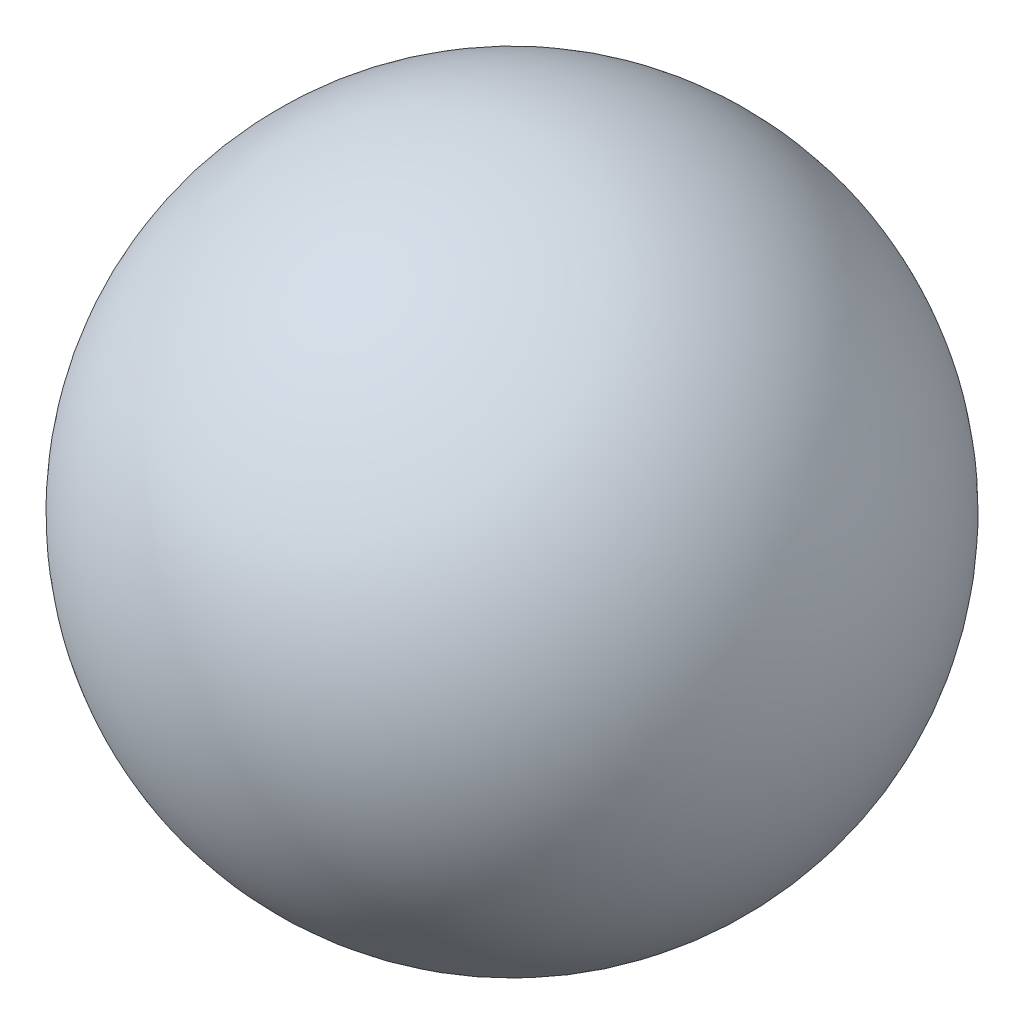
ISO-10303-21;
HEADER;
FILE_DESCRIPTION(('STEP AP214'),'2;1');
FILE_NAME('part.step','',(''),(''),'','','');
FILE_SCHEMA(('AUTOMOTIVE_DESIGN { 1 0 10303 214 1 1 1 1 }'));
ENDSEC;
DATA;
#1=APPLICATION_CONTEXT('core data for automotive mechanical design processes');
#2=APPLICATION_PROTOCOL_DEFINITION('international standard','automotive_design',2000,#1);
#3=PRODUCT_CONTEXT('',#1,'mechanical');
#4=PRODUCT('Part','Part','',(#3));
#5=PRODUCT_RELATED_PRODUCT_CATEGORY('part','',(#4));
#6=PRODUCT_DEFINITION_FORMATION('','',#4);
#7=PRODUCT_DEFINITION_CONTEXT('part definition',#1,'design');
#8=PRODUCT_DEFINITION('design','',#6,#7);
#9=PRODUCT_DEFINITION_SHAPE('','',#8);
#10=(LENGTH_UNIT() NAMED_UNIT(*) SI_UNIT(.MILLI.,.METRE.));
#11=(NAMED_UNIT(*) PLANE_ANGLE_UNIT() SI_UNIT($,.RADIAN.));
#12=(NAMED_UNIT(*) SI_UNIT($,.STERADIAN.) SOLID_ANGLE_UNIT());
#13=UNCERTAINTY_MEASURE_WITH_UNIT(LENGTH_MEASURE(1.E-05),#10,'distance_accuracy_value','');
#14=(GEOMETRIC_REPRESENTATION_CONTEXT(3) GLOBAL_UNCERTAINTY_ASSIGNED_CONTEXT((#13)) GLOBAL_UNIT_ASSIGNED_CONTEXT((#10,
#11,#12)) REPRESENTATION_CONTEXT('',''));
#15=CARTESIAN_POINT('',(0.,0.,0.));
#16=DIRECTION('',(0.,0.,1.));
#17=DIRECTION('',(1.,0.,0.));
#18=AXIS2_PLACEMENT_3D('',#15,#16,#17);
#19=CARTESIAN_POINT('',(0.,-2.,11.75));
#20=DIRECTION('',(0.,0.,1.));
#21=DIRECTION('',(1.,0.,0.));
#22=AXIS2_PLACEMENT_3D('',#19,#20,#21);
#23=SPHERICAL_SURFACE('',#22,1.05);
#24=CARTESIAN_POINT('',(0.,-2.,12.8));
#25=VERTEX_POINT('',#24);
#26=VERTEX_LOOP('',#25);
#27=FACE_BOUND('',#26,.T.);
#28=ADVANCED_FACE('F13',(#27),#23,.T.);
#29=CLOSED_SHELL('',(#28));
#30=MANIFOLD_SOLID_BREP('B1',#29);
#31=ADVANCED_BREP_SHAPE_REPRESENTATION('',(#18,#30),#14);
#32=SHAPE_DEFINITION_REPRESENTATION(#9,#31);
ENDSEC;
END-ISO-10303-21;
